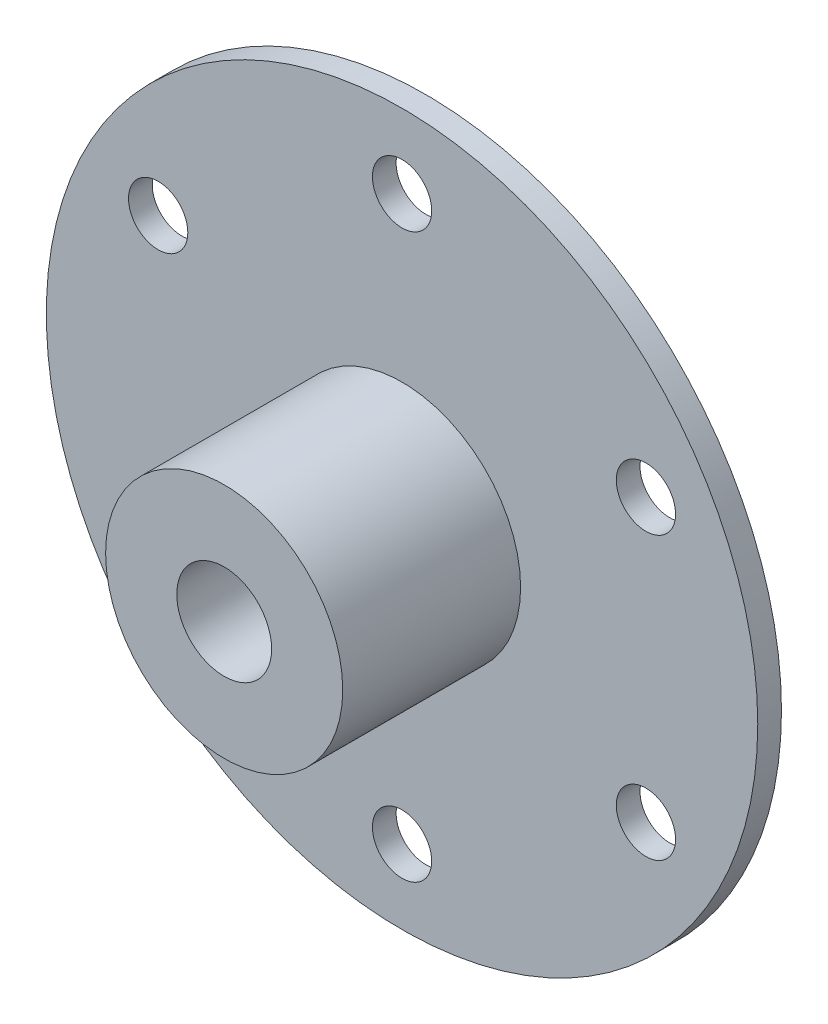
ISO-10303-21;
HEADER;
FILE_DESCRIPTION(('STEP AP214'),'2;1');
FILE_NAME('part.step','',(''),(''),'','','');
FILE_SCHEMA(('AUTOMOTIVE_DESIGN { 1 0 10303 214 1 1 1 1 }'));
ENDSEC;
DATA;
#1=APPLICATION_CONTEXT('core data for automotive mechanical design processes');
#2=APPLICATION_PROTOCOL_DEFINITION('international standard','automotive_design',2000,#1);
#3=PRODUCT_CONTEXT('',#1,'mechanical');
#4=PRODUCT('Part','Part','',(#3));
#5=PRODUCT_RELATED_PRODUCT_CATEGORY('part','',(#4));
#6=PRODUCT_DEFINITION_FORMATION('','',#4);
#7=PRODUCT_DEFINITION_CONTEXT('part definition',#1,'design');
#8=PRODUCT_DEFINITION('design','',#6,#7);
#9=PRODUCT_DEFINITION_SHAPE('','',#8);
#10=(LENGTH_UNIT() NAMED_UNIT(*) SI_UNIT(.MILLI.,.METRE.));
#11=(NAMED_UNIT(*) PLANE_ANGLE_UNIT() SI_UNIT($,.RADIAN.));
#12=(NAMED_UNIT(*) SI_UNIT($,.STERADIAN.) SOLID_ANGLE_UNIT());
#13=UNCERTAINTY_MEASURE_WITH_UNIT(LENGTH_MEASURE(1.E-05),#10,'distance_accuracy_value','');
#14=(GEOMETRIC_REPRESENTATION_CONTEXT(3) GLOBAL_UNCERTAINTY_ASSIGNED_CONTEXT((#13)) GLOBAL_UNIT_ASSIGNED_CONTEXT((#10,
#11,#12)) REPRESENTATION_CONTEXT('',''));
#15=CARTESIAN_POINT('',(0.,0.,0.));
#16=DIRECTION('',(0.,0.,1.));
#17=DIRECTION('',(1.,0.,0.));
#18=AXIS2_PLACEMENT_3D('',#15,#16,#17);
#19=CARTESIAN_POINT('',(0.,0.,2.));
#20=DIRECTION('',(0.,0.,1.));
#21=DIRECTION('',(1.,0.,0.));
#22=AXIS2_PLACEMENT_3D('',#19,#20,#21);
#23=PLANE('',#22);
#24=CARTESIAN_POINT('',(0.,0.,2.));
#25=DIRECTION('',(0.,0.,1.));
#26=DIRECTION('',(1.,0.,0.));
#27=AXIS2_PLACEMENT_3D('',#24,#25,#26);
#28=CIRCLE('',#27,10.);
#29=CARTESIAN_POINT('',(10.,0.,2.));
#30=VERTEX_POINT('',#29);
#31=EDGE_CURVE('E85',#30,#30,#28,.T.);
#32=ORIENTED_EDGE('',*,*,#31,.F.);
#33=EDGE_LOOP('',(#32));
#34=FACE_BOUND('',#33,.T.);
#35=CARTESIAN_POINT('',(-20.5681033398795,-11.874999999999,2.));
#36=DIRECTION('',(0.,0.,1.));
#37=DIRECTION('',(1.,0.,0.));
#38=AXIS2_PLACEMENT_3D('',#35,#36,#37);
#39=CIRCLE('',#38,2.50000000000015);
#40=CARTESIAN_POINT('',(-18.0681033398794,-11.874999999999,2.));
#41=VERTEX_POINT('',#40);
#42=EDGE_CURVE('E70',#41,#41,#39,.T.);
#43=ORIENTED_EDGE('',*,*,#42,.F.);
#44=EDGE_LOOP('',(#43));
#45=FACE_BOUND('',#44,.T.);
#46=CARTESIAN_POINT('',(20.56810333988,-11.8749999999987,2.));
#47=DIRECTION('',(0.,0.,1.));
#48=DIRECTION('',(1.,0.,0.));
#49=AXIS2_PLACEMENT_3D('',#46,#47,#48);
#50=CIRCLE('',#49,2.50000000000127);
#51=CARTESIAN_POINT('',(23.0681033398812,-11.8749999999987,2.));
#52=VERTEX_POINT('',#51);
#53=EDGE_CURVE('E58',#52,#52,#50,.T.);
#54=ORIENTED_EDGE('',*,*,#53,.F.);
#55=EDGE_LOOP('',(#54));
#56=FACE_BOUND('',#55,.T.);
#57=CARTESIAN_POINT('',(0.,23.75,2.));
#58=DIRECTION('',(0.,0.,1.));
#59=DIRECTION('',(1.,0.,0.));
#60=AXIS2_PLACEMENT_3D('',#57,#58,#59);
#61=CIRCLE('',#60,2.5);
#62=CARTESIAN_POINT('',(2.5,23.75,2.));
#63=VERTEX_POINT('',#62);
#64=EDGE_CURVE('E47',#63,#63,#61,.T.);
#65=ORIENTED_EDGE('',*,*,#64,.F.);
#66=EDGE_LOOP('',(#65));
#67=FACE_BOUND('',#66,.T.);
#68=CARTESIAN_POINT('',(0.,0.,2.));
#69=DIRECTION('',(0.,0.,1.));
#70=DIRECTION('',(1.,0.,0.));
#71=AXIS2_PLACEMENT_3D('',#68,#69,#70);
#72=CIRCLE('',#71,30.);
#73=CARTESIAN_POINT('',(30.,0.,2.));
#74=VERTEX_POINT('',#73);
#75=EDGE_CURVE('E38',#74,#74,#72,.T.);
#76=ORIENTED_EDGE('',*,*,#75,.T.);
#77=EDGE_LOOP('',(#76));
#78=FACE_BOUND('',#77,.T.);
#79=CARTESIAN_POINT('',(20.5681033398798,11.8750000000005,2.));
#80=DIRECTION('',(0.,0.,1.));
#81=DIRECTION('',(1.,0.,0.));
#82=AXIS2_PLACEMENT_3D('',#79,#80,#81);
#83=CIRCLE('',#82,2.50000000000085);
#84=CARTESIAN_POINT('',(23.0681033398807,11.8750000000005,2.));
#85=VERTEX_POINT('',#84);
#86=EDGE_CURVE('E52',#85,#85,#83,.T.);
#87=ORIENTED_EDGE('',*,*,#86,.F.);
#88=EDGE_LOOP('',(#87));
#89=FACE_BOUND('',#88,.T.);
#90=CARTESIAN_POINT('',(2.98227860698257E-13,-23.7499999999984,2.));
#91=DIRECTION('',(0.,0.,1.));
#92=DIRECTION('',(1.,0.,0.));
#93=AXIS2_PLACEMENT_3D('',#90,#91,#92);
#94=CIRCLE('',#93,2.5000000000009);
#95=CARTESIAN_POINT('',(2.5000000000012,-23.7499999999984,2.));
#96=VERTEX_POINT('',#95);
#97=EDGE_CURVE('E64',#96,#96,#94,.T.);
#98=ORIENTED_EDGE('',*,*,#97,.F.);
#99=EDGE_LOOP('',(#98));
#100=FACE_BOUND('',#99,.T.);
#101=CARTESIAN_POINT('',(-20.5681033398797,11.8750000000002,2.));
#102=DIRECTION('',(0.,0.,1.));
#103=DIRECTION('',(1.,0.,0.));
#104=AXIS2_PLACEMENT_3D('',#101,#102,#103);
#105=CIRCLE('',#104,2.49999999999986);
#106=CARTESIAN_POINT('',(-18.0681033398798,11.8750000000002,2.));
#107=VERTEX_POINT('',#106);
#108=EDGE_CURVE('E76',#107,#107,#105,.T.);
#109=ORIENTED_EDGE('',*,*,#108,.F.);
#110=EDGE_LOOP('',(#109));
#111=FACE_BOUND('',#110,.T.);
#112=ADVANCED_FACE('F31',(#34,#45,#56,#67,#78,#89,#100,#111),#23,.T.);
#113=CARTESIAN_POINT('',(0.,0.,0.));
#114=DIRECTION('',(0.,0.,1.));
#115=DIRECTION('',(1.,0.,0.));
#116=AXIS2_PLACEMENT_3D('',#113,#114,#115);
#117=PLANE('',#116);
#118=CARTESIAN_POINT('',(0.,0.,0.));
#119=DIRECTION('',(0.,0.,1.));
#120=DIRECTION('',(1.,0.,0.));
#121=AXIS2_PLACEMENT_3D('',#118,#119,#120);
#122=CIRCLE('',#121,30.);
#123=CARTESIAN_POINT('',(30.,0.,0.));
#124=VERTEX_POINT('',#123);
#125=EDGE_CURVE('E42',#124,#124,#122,.T.);
#126=ORIENTED_EDGE('',*,*,#125,.F.);
#127=EDGE_LOOP('',(#126));
#128=FACE_BOUND('',#127,.T.);
#129=CARTESIAN_POINT('',(0.,23.75,0.));
#130=DIRECTION('',(0.,0.,1.));
#131=DIRECTION('',(1.,0.,0.));
#132=AXIS2_PLACEMENT_3D('',#129,#130,#131);
#133=CIRCLE('',#132,2.5);
#134=CARTESIAN_POINT('',(2.5,23.75,0.));
#135=VERTEX_POINT('',#134);
#136=EDGE_CURVE('E49',#135,#135,#133,.T.);
#137=ORIENTED_EDGE('',*,*,#136,.T.);
#138=EDGE_LOOP('',(#137));
#139=FACE_BOUND('',#138,.T.);
#140=CARTESIAN_POINT('',(20.5681033398798,11.8750000000005,0.));
#141=DIRECTION('',(0.,0.,1.));
#142=DIRECTION('',(1.,0.,0.));
#143=AXIS2_PLACEMENT_3D('',#140,#141,#142);
#144=CIRCLE('',#143,2.50000000000085);
#145=CARTESIAN_POINT('',(23.0681033398807,11.8750000000005,0.));
#146=VERTEX_POINT('',#145);
#147=EDGE_CURVE('E55',#146,#146,#144,.T.);
#148=ORIENTED_EDGE('',*,*,#147,.T.);
#149=EDGE_LOOP('',(#148));
#150=FACE_BOUND('',#149,.T.);
#151=CARTESIAN_POINT('',(20.56810333988,-11.8749999999987,0.));
#152=DIRECTION('',(0.,0.,1.));
#153=DIRECTION('',(1.,0.,0.));
#154=AXIS2_PLACEMENT_3D('',#151,#152,#153);
#155=CIRCLE('',#154,2.50000000000127);
#156=CARTESIAN_POINT('',(23.0681033398812,-11.8749999999987,0.));
#157=VERTEX_POINT('',#156);
#158=EDGE_CURVE('E61',#157,#157,#155,.T.);
#159=ORIENTED_EDGE('',*,*,#158,.T.);
#160=EDGE_LOOP('',(#159));
#161=FACE_BOUND('',#160,.T.);
#162=CARTESIAN_POINT('',(2.98227860698257E-13,-23.7499999999984,0.));
#163=DIRECTION('',(0.,0.,1.));
#164=DIRECTION('',(1.,0.,0.));
#165=AXIS2_PLACEMENT_3D('',#162,#163,#164);
#166=CIRCLE('',#165,2.5000000000009);
#167=CARTESIAN_POINT('',(2.5000000000012,-23.7499999999984,0.));
#168=VERTEX_POINT('',#167);
#169=EDGE_CURVE('E67',#168,#168,#166,.T.);
#170=ORIENTED_EDGE('',*,*,#169,.T.);
#171=EDGE_LOOP('',(#170));
#172=FACE_BOUND('',#171,.T.);
#173=CARTESIAN_POINT('',(-20.5681033398795,-11.874999999999,0.));
#174=DIRECTION('',(0.,0.,1.));
#175=DIRECTION('',(1.,0.,0.));
#176=AXIS2_PLACEMENT_3D('',#173,#174,#175);
#177=CIRCLE('',#176,2.50000000000015);
#178=CARTESIAN_POINT('',(-18.0681033398794,-11.874999999999,0.));
#179=VERTEX_POINT('',#178);
#180=EDGE_CURVE('E73',#179,#179,#177,.T.);
#181=ORIENTED_EDGE('',*,*,#180,.T.);
#182=EDGE_LOOP('',(#181));
#183=FACE_BOUND('',#182,.T.);
#184=CARTESIAN_POINT('',(-20.5681033398797,11.8750000000002,0.));
#185=DIRECTION('',(0.,0.,1.));
#186=DIRECTION('',(1.,0.,0.));
#187=AXIS2_PLACEMENT_3D('',#184,#185,#186);
#188=CIRCLE('',#187,2.49999999999986);
#189=CARTESIAN_POINT('',(-18.0681033398798,11.8750000000002,0.));
#190=VERTEX_POINT('',#189);
#191=EDGE_CURVE('E79',#190,#190,#188,.T.);
#192=ORIENTED_EDGE('',*,*,#191,.T.);
#193=EDGE_LOOP('',(#192));
#194=FACE_BOUND('',#193,.T.);
#195=ADVANCED_FACE('F113',(#128,#139,#150,#161,#172,#183,#194),#117,.F.);
#196=CARTESIAN_POINT('',(0.,0.,2.));
#197=DIRECTION('',(0.,0.,-1.));
#198=DIRECTION('',(-1.,0.,0.));
#199=AXIS2_PLACEMENT_3D('',#196,#197,#198);
#200=CYLINDRICAL_SURFACE('',#199,30.);
#201=ORIENTED_EDGE('',*,*,#75,.F.);
#202=EDGE_LOOP('',(#201));
#203=FACE_BOUND('',#202,.T.);
#204=ORIENTED_EDGE('',*,*,#125,.T.);
#205=EDGE_LOOP('',(#204));
#206=FACE_BOUND('',#205,.T.);
#207=ADVANCED_FACE('F33',(#203,#206),#200,.T.);
#208=CARTESIAN_POINT('',(0.,23.75,2.));
#209=DIRECTION('',(0.,0.,-1.));
#210=DIRECTION('',(-1.,0.,0.));
#211=AXIS2_PLACEMENT_3D('',#208,#209,#210);
#212=CYLINDRICAL_SURFACE('',#211,2.5);
#213=ORIENTED_EDGE('',*,*,#64,.T.);
#214=EDGE_LOOP('',(#213));
#215=FACE_BOUND('',#214,.T.);
#216=ORIENTED_EDGE('',*,*,#136,.F.);
#217=EDGE_LOOP('',(#216));
#218=FACE_BOUND('',#217,.T.);
#219=ADVANCED_FACE('F190',(#215,#218),#212,.F.);
#220=CARTESIAN_POINT('',(20.5681033398798,11.8750000000005,2.));
#221=DIRECTION('',(0.,0.,-1.));
#222=DIRECTION('',(-1.,0.,0.));
#223=AXIS2_PLACEMENT_3D('',#220,#221,#222);
#224=CYLINDRICAL_SURFACE('',#223,2.50000000000085);
#225=ORIENTED_EDGE('',*,*,#86,.T.);
#226=EDGE_LOOP('',(#225));
#227=FACE_BOUND('',#226,.T.);
#228=ORIENTED_EDGE('',*,*,#147,.F.);
#229=EDGE_LOOP('',(#228));
#230=FACE_BOUND('',#229,.T.);
#231=ADVANCED_FACE('F180',(#227,#230),#224,.F.);
#232=CARTESIAN_POINT('',(20.56810333988,-11.8749999999987,2.));
#233=DIRECTION('',(0.,0.,-1.));
#234=DIRECTION('',(-1.,0.,0.));
#235=AXIS2_PLACEMENT_3D('',#232,#233,#234);
#236=CYLINDRICAL_SURFACE('',#235,2.50000000000127);
#237=ORIENTED_EDGE('',*,*,#53,.T.);
#238=EDGE_LOOP('',(#237));
#239=FACE_BOUND('',#238,.T.);
#240=ORIENTED_EDGE('',*,*,#158,.F.);
#241=EDGE_LOOP('',(#240));
#242=FACE_BOUND('',#241,.T.);
#243=ADVANCED_FACE('F170',(#239,#242),#236,.F.);
#244=CARTESIAN_POINT('',(2.98227860698257E-13,-23.7499999999984,2.));
#245=DIRECTION('',(0.,0.,-1.));
#246=DIRECTION('',(-1.,0.,0.));
#247=AXIS2_PLACEMENT_3D('',#244,#245,#246);
#248=CYLINDRICAL_SURFACE('',#247,2.5000000000009);
#249=ORIENTED_EDGE('',*,*,#97,.T.);
#250=EDGE_LOOP('',(#249));
#251=FACE_BOUND('',#250,.T.);
#252=ORIENTED_EDGE('',*,*,#169,.F.);
#253=EDGE_LOOP('',(#252));
#254=FACE_BOUND('',#253,.T.);
#255=ADVANCED_FACE('F160',(#251,#254),#248,.F.);
#256=CARTESIAN_POINT('',(-20.5681033398795,-11.874999999999,2.));
#257=DIRECTION('',(0.,0.,-1.));
#258=DIRECTION('',(-1.,0.,0.));
#259=AXIS2_PLACEMENT_3D('',#256,#257,#258);
#260=CYLINDRICAL_SURFACE('',#259,2.50000000000015);
#261=ORIENTED_EDGE('',*,*,#42,.T.);
#262=EDGE_LOOP('',(#261));
#263=FACE_BOUND('',#262,.T.);
#264=ORIENTED_EDGE('',*,*,#180,.F.);
#265=EDGE_LOOP('',(#264));
#266=FACE_BOUND('',#265,.T.);
#267=ADVANCED_FACE('F108',(#263,#266),#260,.F.);
#268=CARTESIAN_POINT('',(-20.5681033398797,11.8750000000002,2.));
#269=DIRECTION('',(0.,0.,-1.));
#270=DIRECTION('',(-1.,0.,0.));
#271=AXIS2_PLACEMENT_3D('',#268,#269,#270);
#272=CYLINDRICAL_SURFACE('',#271,2.49999999999986);
#273=ORIENTED_EDGE('',*,*,#108,.T.);
#274=EDGE_LOOP('',(#273));
#275=FACE_BOUND('',#274,.T.);
#276=ORIENTED_EDGE('',*,*,#191,.F.);
#277=EDGE_LOOP('',(#276));
#278=FACE_BOUND('',#277,.T.);
#279=ADVANCED_FACE('F99',(#275,#278),#272,.F.);
#280=CARTESIAN_POINT('',(0.,0.,17.));
#281=DIRECTION('',(0.,0.,1.));
#282=DIRECTION('',(1.,0.,0.));
#283=AXIS2_PLACEMENT_3D('',#280,#281,#282);
#284=PLANE('',#283);
#285=CARTESIAN_POINT('',(0.,0.,17.));
#286=DIRECTION('',(0.,0.,1.));
#287=DIRECTION('',(1.,0.,0.));
#288=AXIS2_PLACEMENT_3D('',#285,#286,#287);
#289=CIRCLE('',#288,10.);
#290=CARTESIAN_POINT('',(10.,0.,17.));
#291=VERTEX_POINT('',#290);
#292=EDGE_CURVE('E82',#291,#291,#289,.T.);
#293=ORIENTED_EDGE('',*,*,#292,.T.);
#294=EDGE_LOOP('',(#293));
#295=FACE_BOUND('',#294,.T.);
#296=CARTESIAN_POINT('',(0.,0.,17.));
#297=DIRECTION('',(0.,0.,1.));
#298=DIRECTION('',(1.,0.,0.));
#299=AXIS2_PLACEMENT_3D('',#296,#297,#298);
#300=CIRCLE('',#299,4.);
#301=CARTESIAN_POINT('',(4.,0.,17.));
#302=VERTEX_POINT('',#301);
#303=EDGE_CURVE('E88',#302,#302,#300,.T.);
#304=ORIENTED_EDGE('',*,*,#303,.F.);
#305=EDGE_LOOP('',(#304));
#306=FACE_BOUND('',#305,.T.);
#307=ADVANCED_FACE('F96',(#295,#306),#284,.T.);
#308=CARTESIAN_POINT('',(0.,0.,17.));
#309=DIRECTION('',(0.,0.,-1.));
#310=DIRECTION('',(-1.,0.,0.));
#311=AXIS2_PLACEMENT_3D('',#308,#309,#310);
#312=CYLINDRICAL_SURFACE('',#311,10.);
#313=ORIENTED_EDGE('',*,*,#292,.F.);
#314=EDGE_LOOP('',(#313));
#315=FACE_BOUND('',#314,.T.);
#316=ORIENTED_EDGE('',*,*,#31,.T.);
#317=EDGE_LOOP('',(#316));
#318=FACE_BOUND('',#317,.T.);
#319=ADVANCED_FACE('F98',(#315,#318),#312,.T.);
#320=CARTESIAN_POINT('',(0.,0.,17.));
#321=DIRECTION('',(0.,0.,-1.));
#322=DIRECTION('',(-1.,0.,0.));
#323=AXIS2_PLACEMENT_3D('',#320,#321,#322);
#324=CYLINDRICAL_SURFACE('',#323,4.);
#325=ORIENTED_EDGE('',*,*,#303,.T.);
#326=EDGE_LOOP('',(#325));
#327=FACE_BOUND('',#326,.T.);
#328=CARTESIAN_POINT('',(0.,0.,2.));
#329=DIRECTION('',(0.,0.,1.));
#330=DIRECTION('',(1.,0.,0.));
#331=AXIS2_PLACEMENT_3D('',#328,#329,#330);
#332=CIRCLE('',#331,4.);
#333=CARTESIAN_POINT('',(4.,0.,2.));
#334=VERTEX_POINT('',#333);
#335=EDGE_CURVE('E10',#334,#334,#332,.F.);
#336=ORIENTED_EDGE('',*,*,#335,.T.);
#337=EDGE_LOOP('',(#336));
#338=FACE_BOUND('',#337,.T.);
#339=ADVANCED_FACE('F94',(#327,#338),#324,.F.);
#340=ORIENTED_EDGE('',*,*,#335,.F.);
#341=EDGE_LOOP('',(#340));
#342=FACE_BOUND('',#341,.T.);
#343=ADVANCED_FACE('F116',(#342),#23,.T.);
#344=CLOSED_SHELL('',(#112,#195,#207,#219,#231,#243,#255,#267,#279,#307,#319,#339,#343));
#345=MANIFOLD_SOLID_BREP('B2',#344);
#346=ADVANCED_BREP_SHAPE_REPRESENTATION('',(#18,#345),#14);
#347=SHAPE_DEFINITION_REPRESENTATION(#9,#346);
ENDSEC;
END-ISO-10303-21;
